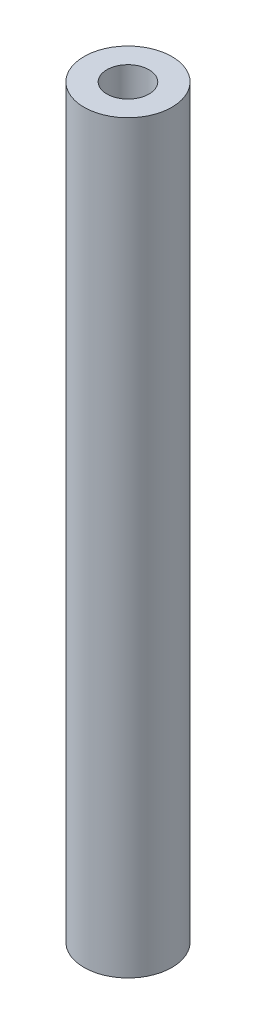
ISO-10303-21;
HEADER;
FILE_DESCRIPTION(('STEP AP214'),'2;1');
FILE_NAME('part.step','',(''),(''),'','','');
FILE_SCHEMA(('AUTOMOTIVE_DESIGN { 1 0 10303 214 1 1 1 1 }'));
ENDSEC;
DATA;
#1=APPLICATION_CONTEXT('core data for automotive mechanical design processes');
#2=APPLICATION_PROTOCOL_DEFINITION('international standard','automotive_design',2000,#1);
#3=PRODUCT_CONTEXT('',#1,'mechanical');
#4=PRODUCT('Part','Part','',(#3));
#5=PRODUCT_RELATED_PRODUCT_CATEGORY('part','',(#4));
#6=PRODUCT_DEFINITION_FORMATION('','',#4);
#7=PRODUCT_DEFINITION_CONTEXT('part definition',#1,'design');
#8=PRODUCT_DEFINITION('design','',#6,#7);
#9=PRODUCT_DEFINITION_SHAPE('','',#8);
#10=(LENGTH_UNIT() NAMED_UNIT(*) SI_UNIT(.MILLI.,.METRE.));
#11=(NAMED_UNIT(*) PLANE_ANGLE_UNIT() SI_UNIT($,.RADIAN.));
#12=(NAMED_UNIT(*) SI_UNIT($,.STERADIAN.) SOLID_ANGLE_UNIT());
#13=UNCERTAINTY_MEASURE_WITH_UNIT(LENGTH_MEASURE(1.E-05),#10,'distance_accuracy_value','');
#14=(GEOMETRIC_REPRESENTATION_CONTEXT(3) GLOBAL_UNCERTAINTY_ASSIGNED_CONTEXT((#13)) GLOBAL_UNIT_ASSIGNED_CONTEXT((#10,
#11,#12)) REPRESENTATION_CONTEXT('',''));
#15=CARTESIAN_POINT('',(0.,0.,0.));
#16=DIRECTION('',(0.,0.,1.));
#17=DIRECTION('',(1.,0.,0.));
#18=AXIS2_PLACEMENT_3D('',#15,#16,#17);
#19=CARTESIAN_POINT('',(0.,53.83403,0.));
#20=DIRECTION('',(0.,1.,0.));
#21=DIRECTION('',(0.,0.,1.));
#22=AXIS2_PLACEMENT_3D('',#19,#20,#21);
#23=PLANE('',#22);
#24=CARTESIAN_POINT('',(0.,53.83403,0.));
#25=DIRECTION('',(0.,1.,0.));
#26=DIRECTION('',(0.,0.,1.));
#27=AXIS2_PLACEMENT_3D('',#24,#25,#26);
#28=CIRCLE('',#27,3.175);
#29=CARTESIAN_POINT('',(0.,53.83403,3.175));
#30=VERTEX_POINT('',#29);
#31=EDGE_CURVE('E10',#30,#30,#28,.T.);
#32=ORIENTED_EDGE('',*,*,#31,.T.);
#33=EDGE_LOOP('',(#32));
#34=FACE_BOUND('',#33,.T.);
#35=CARTESIAN_POINT('',(0.,53.83403,0.));
#36=DIRECTION('',(0.,1.,0.));
#37=DIRECTION('',(0.,0.,1.));
#38=AXIS2_PLACEMENT_3D('',#35,#36,#37);
#39=CIRCLE('',#38,1.524);
#40=CARTESIAN_POINT('',(0.,53.83403,1.524));
#41=VERTEX_POINT('',#40);
#42=EDGE_CURVE('E47',#41,#41,#39,.T.);
#43=ORIENTED_EDGE('',*,*,#42,.F.);
#44=EDGE_LOOP('',(#43));
#45=FACE_BOUND('',#44,.T.);
#46=ADVANCED_FACE('F36',(#34,#45),#23,.T.);
#47=CARTESIAN_POINT('',(0.,0.,0.));
#48=DIRECTION('',(0.,1.,0.));
#49=DIRECTION('',(0.,0.,1.));
#50=AXIS2_PLACEMENT_3D('',#47,#48,#49);
#51=PLANE('',#50);
#52=CARTESIAN_POINT('',(0.,0.,0.));
#53=DIRECTION('',(0.,1.,0.));
#54=DIRECTION('',(0.,0.,1.));
#55=AXIS2_PLACEMENT_3D('',#52,#53,#54);
#56=CIRCLE('',#55,3.175);
#57=CARTESIAN_POINT('',(0.,0.,3.175));
#58=VERTEX_POINT('',#57);
#59=EDGE_CURVE('E40',#58,#58,#56,.T.);
#60=ORIENTED_EDGE('',*,*,#59,.F.);
#61=EDGE_LOOP('',(#60));
#62=FACE_BOUND('',#61,.T.);
#63=CARTESIAN_POINT('',(0.,0.,0.));
#64=DIRECTION('',(0.,1.,0.));
#65=DIRECTION('',(0.,0.,1.));
#66=AXIS2_PLACEMENT_3D('',#63,#64,#65);
#67=CIRCLE('',#66,1.524);
#68=CARTESIAN_POINT('',(0.,0.,1.524));
#69=VERTEX_POINT('',#68);
#70=EDGE_CURVE('E49',#69,#69,#67,.T.);
#71=ORIENTED_EDGE('',*,*,#70,.T.);
#72=EDGE_LOOP('',(#71));
#73=FACE_BOUND('',#72,.T.);
#74=ADVANCED_FACE('F59',(#62,#73),#51,.F.);
#75=CARTESIAN_POINT('',(0.,53.83403,0.));
#76=DIRECTION('',(0.,-1.,0.));
#77=DIRECTION('',(0.,0.,-1.));
#78=AXIS2_PLACEMENT_3D('',#75,#76,#77);
#79=CYLINDRICAL_SURFACE('',#78,3.175);
#80=ORIENTED_EDGE('',*,*,#31,.F.);
#81=EDGE_LOOP('',(#80));
#82=FACE_BOUND('',#81,.T.);
#83=ORIENTED_EDGE('',*,*,#59,.T.);
#84=EDGE_LOOP('',(#83));
#85=FACE_BOUND('',#84,.T.);
#86=ADVANCED_FACE('F38',(#82,#85),#79,.T.);
#87=CARTESIAN_POINT('',(0.,53.83403,0.));
#88=DIRECTION('',(0.,-1.,0.));
#89=DIRECTION('',(0.,0.,-1.));
#90=AXIS2_PLACEMENT_3D('',#87,#88,#89);
#91=CYLINDRICAL_SURFACE('',#90,1.524);
#92=ORIENTED_EDGE('',*,*,#42,.T.);
#93=EDGE_LOOP('',(#92));
#94=FACE_BOUND('',#93,.T.);
#95=ORIENTED_EDGE('',*,*,#70,.F.);
#96=EDGE_LOOP('',(#95));
#97=FACE_BOUND('',#96,.T.);
#98=ADVANCED_FACE('F55',(#94,#97),#91,.F.);
#99=CLOSED_SHELL('',(#46,#74,#86,#98));
#100=MANIFOLD_SOLID_BREP('B2',#99);
#101=ADVANCED_BREP_SHAPE_REPRESENTATION('',(#18,#100),#14);
#102=SHAPE_DEFINITION_REPRESENTATION(#9,#101);
ENDSEC;
END-ISO-10303-21;
